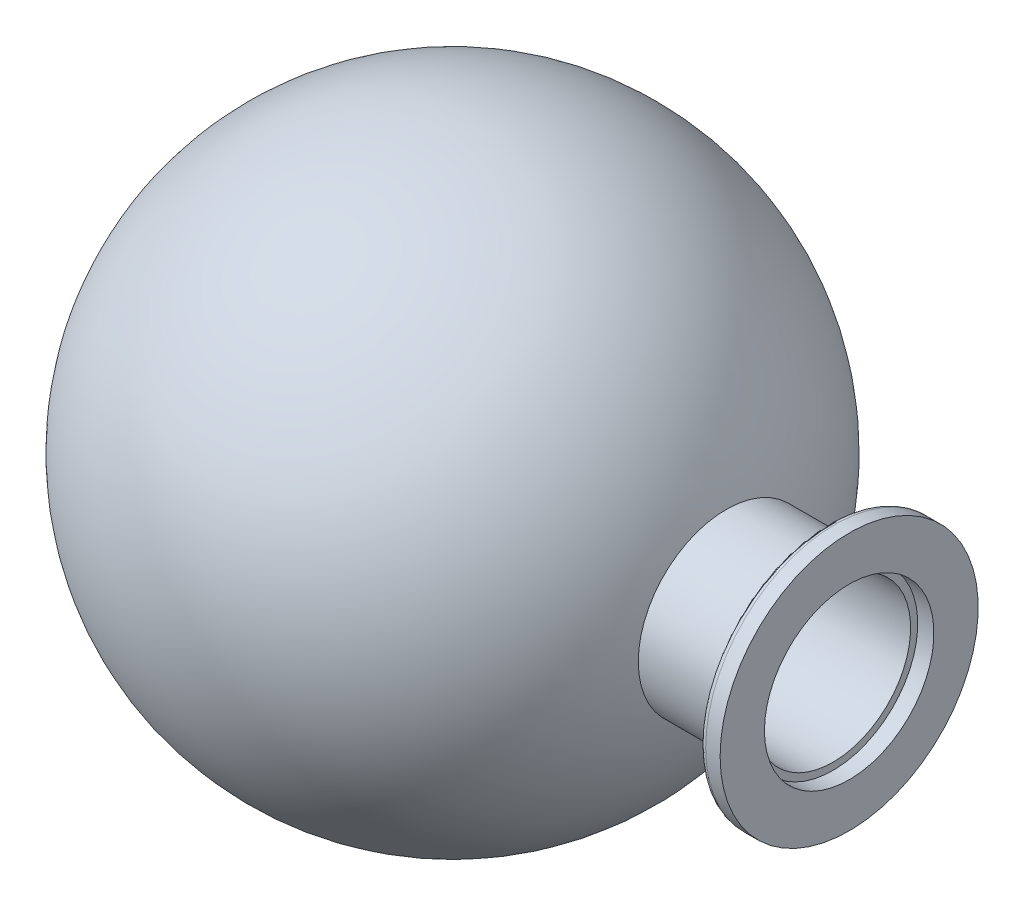
ISO-10303-21;
HEADER;
FILE_DESCRIPTION(('STEP AP214'),'2;1');
FILE_NAME('part.step','',(''),(''),'','','');
FILE_SCHEMA(('AUTOMOTIVE_DESIGN { 1 0 10303 214 1 1 1 1 }'));
ENDSEC;
DATA;
#1=APPLICATION_CONTEXT('core data for automotive mechanical design processes');
#2=APPLICATION_PROTOCOL_DEFINITION('international standard','automotive_design',2000,#1);
#3=PRODUCT_CONTEXT('',#1,'mechanical');
#4=PRODUCT('Part','Part','',(#3));
#5=PRODUCT_RELATED_PRODUCT_CATEGORY('part','',(#4));
#6=PRODUCT_DEFINITION_FORMATION('','',#4);
#7=PRODUCT_DEFINITION_CONTEXT('part definition',#1,'design');
#8=PRODUCT_DEFINITION('design','',#6,#7);
#9=PRODUCT_DEFINITION_SHAPE('','',#8);
#10=(LENGTH_UNIT() NAMED_UNIT(*) SI_UNIT(.MILLI.,.METRE.));
#11=(NAMED_UNIT(*) PLANE_ANGLE_UNIT() SI_UNIT($,.RADIAN.));
#12=(NAMED_UNIT(*) SI_UNIT($,.STERADIAN.) SOLID_ANGLE_UNIT());
#13=UNCERTAINTY_MEASURE_WITH_UNIT(LENGTH_MEASURE(1.E-05),#10,'distance_accuracy_value','');
#14=(GEOMETRIC_REPRESENTATION_CONTEXT(3) GLOBAL_UNCERTAINTY_ASSIGNED_CONTEXT((#13)) GLOBAL_UNIT_ASSIGNED_CONTEXT((#10,
#11,#12)) REPRESENTATION_CONTEXT('',''));
#15=CARTESIAN_POINT('',(0.,0.,0.));
#16=DIRECTION('',(0.,0.,1.));
#17=DIRECTION('',(1.,0.,0.));
#18=AXIS2_PLACEMENT_3D('',#15,#16,#17);
#19=CARTESIAN_POINT('',(-48.0909556313993,0.,0.));
#20=DIRECTION('',(-1.,0.,0.));
#21=DIRECTION('',(0.,0.,1.));
#22=AXIS2_PLACEMENT_3D('',#19,#20,#21);
#23=CYLINDRICAL_SURFACE('',#22,13.1);
#24=CARTESIAN_POINT('',(61.3183470849229,0.,0.));
#25=DIRECTION('',(-1.,0.,0.));
#26=DIRECTION('',(0.,0.,1.));
#27=AXIS2_PLACEMENT_3D('',#24,#25,#26);
#28=CIRCLE('',#27,13.1);
#29=CARTESIAN_POINT('',(61.3183470849229,0.,13.1));
#30=VERTEX_POINT('',#29);
#31=EDGE_CURVE('E12',#30,#30,#28,.T.);
#32=ORIENTED_EDGE('',*,*,#31,.F.);
#33=EDGE_LOOP('',(#32));
#34=FACE_BOUND('',#33,.T.);
#35=CARTESIAN_POINT('',(58.8183470849229,0.,0.));
#36=DIRECTION('',(-1.,0.,0.));
#37=DIRECTION('',(0.,0.,1.));
#38=AXIS2_PLACEMENT_3D('',#35,#36,#37);
#39=CIRCLE('',#38,13.1);
#40=CARTESIAN_POINT('',(58.8183470849229,0.,13.1));
#41=VERTEX_POINT('',#40);
#42=EDGE_CURVE('E84',#41,#41,#39,.T.);
#43=ORIENTED_EDGE('',*,*,#42,.T.);
#44=EDGE_LOOP('',(#43));
#45=FACE_BOUND('',#44,.T.);
#46=ADVANCED_FACE('F53',(#34,#45),#23,.F.);
#47=CARTESIAN_POINT('',(61.3183470849229,19.95,0.));
#48=DIRECTION('',(-1.,0.,0.));
#49=DIRECTION('',(0.,0.,1.));
#50=AXIS2_PLACEMENT_3D('',#47,#48,#49);
#51=PLANE('',#50);
#52=CARTESIAN_POINT('',(61.3183470849229,0.,0.));
#53=DIRECTION('',(-1.,0.,0.));
#54=DIRECTION('',(0.,0.,1.));
#55=AXIS2_PLACEMENT_3D('',#52,#53,#54);
#56=CIRCLE('',#55,19.95);
#57=CARTESIAN_POINT('',(61.3183470849229,0.,19.95));
#58=VERTEX_POINT('',#57);
#59=EDGE_CURVE('E59',#58,#58,#56,.T.);
#60=ORIENTED_EDGE('',*,*,#59,.F.);
#61=EDGE_LOOP('',(#60));
#62=FACE_BOUND('',#61,.T.);
#63=ORIENTED_EDGE('',*,*,#31,.T.);
#64=EDGE_LOOP('',(#63));
#65=FACE_BOUND('',#64,.T.);
#66=ADVANCED_FACE('F127',(#62,#65),#51,.F.);
#67=CARTESIAN_POINT('',(-48.0909556313993,0.,0.));
#68=DIRECTION('',(-1.,0.,0.));
#69=DIRECTION('',(0.,0.,1.));
#70=AXIS2_PLACEMENT_3D('',#67,#68,#69);
#71=CYLINDRICAL_SURFACE('',#70,19.95);
#72=CARTESIAN_POINT('',(59.0856740729018,0.,0.));
#73=DIRECTION('',(-1.,0.,0.));
#74=DIRECTION('',(0.,0.,1.));
#75=AXIS2_PLACEMENT_3D('',#72,#73,#74);
#76=CIRCLE('',#75,19.95);
#77=CARTESIAN_POINT('',(59.0856740729018,0.,19.95));
#78=VERTEX_POINT('',#77);
#79=EDGE_CURVE('E63',#78,#78,#76,.T.);
#80=ORIENTED_EDGE('',*,*,#79,.F.);
#81=EDGE_LOOP('',(#80));
#82=FACE_BOUND('',#81,.T.);
#83=ORIENTED_EDGE('',*,*,#59,.T.);
#84=EDGE_LOOP('',(#83));
#85=FACE_BOUND('',#84,.T.);
#86=ADVANCED_FACE('F122',(#82,#85),#71,.T.);
#87=CARTESIAN_POINT('',(59.0856740729018,0.,0.));
#88=DIRECTION('',(-1.,0.,0.));
#89=DIRECTION('',(0.,0.,1.));
#90=AXIS2_PLACEMENT_3D('',#87,#88,#89);
#91=TOROIDAL_SURFACE('',#90,18.95,1.);
#92=CARTESIAN_POINT('',(58.1197482466128,0.,0.));
#93=DIRECTION('',(-1.,0.,0.));
#94=DIRECTION('',(0.,0.,1.));
#95=AXIS2_PLACEMENT_3D('',#92,#93,#94);
#96=CIRCLE('',#95,19.2088190451025);
#97=CARTESIAN_POINT('',(58.1197482466128,0.,19.2088190451025));
#98=VERTEX_POINT('',#97);
#99=EDGE_CURVE('E67',#98,#98,#96,.T.);
#100=ORIENTED_EDGE('',*,*,#99,.F.);
#101=EDGE_LOOP('',(#100));
#102=FACE_BOUND('',#101,.T.);
#103=ORIENTED_EDGE('',*,*,#79,.T.);
#104=EDGE_LOOP('',(#103));
#105=FACE_BOUND('',#104,.T.);
#106=ADVANCED_FACE('F116',(#102,#105),#91,.T.);
#107=CARTESIAN_POINT('',(58.1197482466128,0.,0.));
#108=DIRECTION('',(1.,0.,0.));
#109=DIRECTION('',(0.,0.,-1.));
#110=AXIS2_PLACEMENT_3D('',#107,#108,#109);
#111=CONICAL_SURFACE('',#110,19.2088190451025,1.30899693899575);
#112=CARTESIAN_POINT('',(56.6168697129853,0.,0.));
#113=DIRECTION('',(-1.,0.,0.));
#114=DIRECTION('',(0.,0.,1.));
#115=AXIS2_PLACEMENT_3D('',#112,#113,#114);
#116=CIRCLE('',#115,13.6);
#117=CARTESIAN_POINT('',(56.6168697129853,0.,13.6));
#118=VERTEX_POINT('',#117);
#119=EDGE_CURVE('E72',#118,#118,#116,.T.);
#120=ORIENTED_EDGE('',*,*,#119,.F.);
#121=EDGE_LOOP('',(#120));
#122=FACE_BOUND('',#121,.T.);
#123=ORIENTED_EDGE('',*,*,#99,.T.);
#124=EDGE_LOOP('',(#123));
#125=FACE_BOUND('',#124,.T.);
#126=ADVANCED_FACE('F110',(#122,#125),#111,.T.);
#127=CARTESIAN_POINT('',(-48.0909556313993,0.,0.));
#128=DIRECTION('',(-1.,0.,0.));
#129=DIRECTION('',(0.,0.,1.));
#130=AXIS2_PLACEMENT_3D('',#127,#128,#129);
#131=CYLINDRICAL_SURFACE('',#130,13.6);
#132=CARTESIAN_POINT('',(42.3183470849229,0.,0.));
#133=DIRECTION('',(-1.,0.,0.));
#134=DIRECTION('',(0.,0.,1.));
#135=AXIS2_PLACEMENT_3D('',#132,#133,#134);
#136=CIRCLE('',#135,13.6);
#137=CARTESIAN_POINT('',(42.3183470849229,0.,13.6));
#138=VERTEX_POINT('',#137);
#139=EDGE_CURVE('E75',#138,#138,#136,.T.);
#140=ORIENTED_EDGE('',*,*,#139,.F.);
#141=EDGE_LOOP('',(#140));
#142=FACE_BOUND('',#141,.T.);
#143=ORIENTED_EDGE('',*,*,#119,.T.);
#144=EDGE_LOOP('',(#143));
#145=FACE_BOUND('',#144,.T.);
#146=ADVANCED_FACE('F104',(#142,#145),#131,.T.);
#147=CARTESIAN_POINT('',(0.,0.,0.));
#148=DIRECTION('',(-1.,0.,0.));
#149=DIRECTION('',(0.,1.,0.));
#150=AXIS2_PLACEMENT_3D('',#147,#148,#149);
#151=SPHERICAL_SURFACE('',#150,44.45);
#152=CARTESIAN_POINT('',(-42.7995619136458,0.,0.));
#153=DIRECTION('',(-1.,0.,0.));
#154=DIRECTION('',(0.,0.,1.));
#155=AXIS2_PLACEMENT_3D('',#152,#153,#154);
#156=CIRCLE('',#155,12.);
#157=CARTESIAN_POINT('',(-42.7995619136458,0.,12.));
#158=VERTEX_POINT('',#157);
#159=EDGE_CURVE('E78',#158,#158,#156,.T.);
#160=ORIENTED_EDGE('',*,*,#159,.F.);
#161=EDGE_LOOP('',(#160));
#162=FACE_BOUND('',#161,.T.);
#163=ORIENTED_EDGE('',*,*,#139,.T.);
#164=EDGE_LOOP('',(#163));
#165=FACE_BOUND('',#164,.T.);
#166=ADVANCED_FACE('F98',(#162,#165),#151,.T.);
#167=CARTESIAN_POINT('',(-48.0909556313993,0.,0.));
#168=DIRECTION('',(-1.,0.,0.));
#169=DIRECTION('',(0.,0.,1.));
#170=AXIS2_PLACEMENT_3D('',#167,#168,#169);
#171=CYLINDRICAL_SURFACE('',#170,12.);
#172=CARTESIAN_POINT('',(58.8183470849229,0.,0.));
#173=DIRECTION('',(-1.,0.,0.));
#174=DIRECTION('',(0.,0.,1.));
#175=AXIS2_PLACEMENT_3D('',#172,#173,#174);
#176=CIRCLE('',#175,12.);
#177=CARTESIAN_POINT('',(58.8183470849229,0.,12.));
#178=VERTEX_POINT('',#177);
#179=EDGE_CURVE('E81',#178,#178,#176,.T.);
#180=ORIENTED_EDGE('',*,*,#179,.F.);
#181=EDGE_LOOP('',(#180));
#182=FACE_BOUND('',#181,.T.);
#183=ORIENTED_EDGE('',*,*,#159,.T.);
#184=EDGE_LOOP('',(#183));
#185=FACE_BOUND('',#184,.T.);
#186=ADVANCED_FACE('F92',(#182,#185),#171,.F.);
#187=CARTESIAN_POINT('',(58.8183470849229,13.1,0.));
#188=DIRECTION('',(-1.,0.,0.));
#189=DIRECTION('',(0.,0.,1.));
#190=AXIS2_PLACEMENT_3D('',#187,#188,#189);
#191=PLANE('',#190);
#192=ORIENTED_EDGE('',*,*,#42,.F.);
#193=EDGE_LOOP('',(#192));
#194=FACE_BOUND('',#193,.T.);
#195=ORIENTED_EDGE('',*,*,#179,.T.);
#196=EDGE_LOOP('',(#195));
#197=FACE_BOUND('',#196,.T.);
#198=ADVANCED_FACE('F89',(#194,#197),#191,.F.);
#199=CLOSED_SHELL('',(#46,#66,#86,#106,#126,#146,#166,#186,#198));
#200=MANIFOLD_SOLID_BREP('B2',#199);
#201=ADVANCED_BREP_SHAPE_REPRESENTATION('',(#18,#200),#14);
#202=SHAPE_DEFINITION_REPRESENTATION(#9,#201);
ENDSEC;
END-ISO-10303-21;
